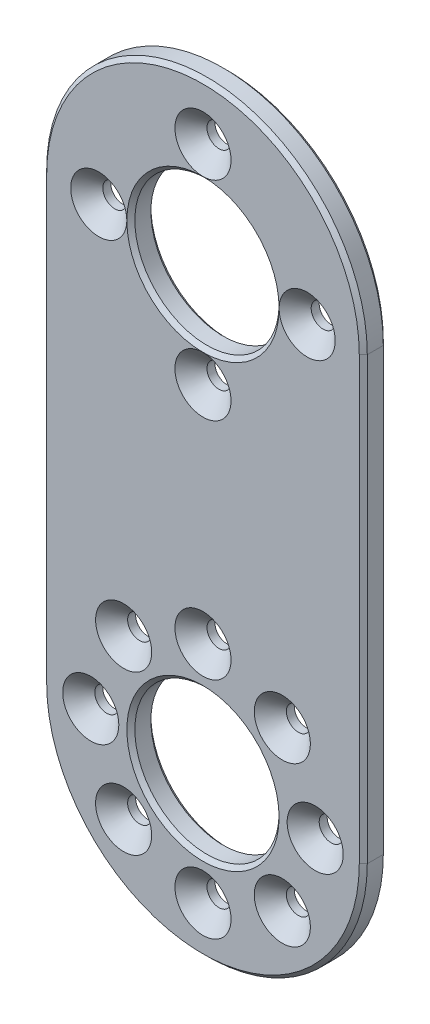
ISO-10303-21;
HEADER;
FILE_DESCRIPTION(('STEP AP214'),'2;1');
FILE_NAME('part.step','',(''),(''),'','','');
FILE_SCHEMA(('AUTOMOTIVE_DESIGN { 1 0 10303 214 1 1 1 1 }'));
ENDSEC;
DATA;
#1=APPLICATION_CONTEXT('core data for automotive mechanical design processes');
#2=APPLICATION_PROTOCOL_DEFINITION('international standard','automotive_design',2000,#1);
#3=PRODUCT_CONTEXT('',#1,'mechanical');
#4=PRODUCT('Part','Part','',(#3));
#5=PRODUCT_RELATED_PRODUCT_CATEGORY('part','',(#4));
#6=PRODUCT_DEFINITION_FORMATION('','',#4);
#7=PRODUCT_DEFINITION_CONTEXT('part definition',#1,'design');
#8=PRODUCT_DEFINITION('design','',#6,#7);
#9=PRODUCT_DEFINITION_SHAPE('','',#8);
#10=(LENGTH_UNIT() NAMED_UNIT(*) SI_UNIT(.MILLI.,.METRE.));
#11=(NAMED_UNIT(*) PLANE_ANGLE_UNIT() SI_UNIT($,.RADIAN.));
#12=(NAMED_UNIT(*) SI_UNIT($,.STERADIAN.) SOLID_ANGLE_UNIT());
#13=UNCERTAINTY_MEASURE_WITH_UNIT(LENGTH_MEASURE(1.E-05),#10,'distance_accuracy_value','');
#14=(GEOMETRIC_REPRESENTATION_CONTEXT(3) GLOBAL_UNCERTAINTY_ASSIGNED_CONTEXT((#13)) GLOBAL_UNIT_ASSIGNED_CONTEXT((#10,
#11,#12)) REPRESENTATION_CONTEXT('',''));
#15=CARTESIAN_POINT('',(0.,0.,0.));
#16=DIRECTION('',(0.,0.,1.));
#17=DIRECTION('',(1.,0.,0.));
#18=AXIS2_PLACEMENT_3D('',#15,#16,#17);
#19=CARTESIAN_POINT('',(20.,0.,3.));
#20=DIRECTION('',(0.,0.,1.));
#21=DIRECTION('',(1.,0.,0.));
#22=AXIS2_PLACEMENT_3D('',#19,#20,#21);
#23=PLANE('',#22);
#24=CARTESIAN_POINT('',(20.,0.,3.));
#25=DIRECTION('',(0.,0.,1.));
#26=DIRECTION('',(1.,0.,0.));
#27=AXIS2_PLACEMENT_3D('',#24,#25,#26);
#28=CIRCLE('',#27,9.49999999999999);
#29=CARTESIAN_POINT('',(29.5,0.,3.));
#30=VERTEX_POINT('',#29);
#31=EDGE_CURVE('E174',#30,#30,#28,.F.);
#32=ORIENTED_EDGE('',*,*,#31,.T.);
#33=EDGE_LOOP('',(#32));
#34=FACE_BOUND('',#33,.T.);
#35=DIRECTION('',(0.,1.,0.));
#36=VECTOR('',#35,1.);
#37=CARTESIAN_POINT('',(39.5,55.,3.));
#38=LINE('',#37,#36);
#39=CARTESIAN_POINT('',(39.5,0.,3.));
#40=VERTEX_POINT('',#39);
#41=CARTESIAN_POINT('',(39.5,55.,3.));
#42=VERTEX_POINT('',#41);
#43=EDGE_CURVE('E156',#40,#42,#38,.T.);
#44=ORIENTED_EDGE('',*,*,#43,.T.);
#45=CARTESIAN_POINT('',(20.,55.,3.));
#46=DIRECTION('',(0.,0.,1.));
#47=DIRECTION('',(1.,0.,0.));
#48=AXIS2_PLACEMENT_3D('',#45,#46,#47);
#49=CIRCLE('',#48,19.5);
#50=CARTESIAN_POINT('',(0.5,55.,3.));
#51=VERTEX_POINT('',#50);
#52=EDGE_CURVE('E162',#42,#51,#49,.T.);
#53=ORIENTED_EDGE('',*,*,#52,.T.);
#54=DIRECTION('',(0.,-1.,0.));
#55=VECTOR('',#54,1.);
#56=CARTESIAN_POINT('',(0.5,0.,3.));
#57=LINE('',#56,#55);
#58=CARTESIAN_POINT('',(0.499999999999987,0.,3.));
#59=VERTEX_POINT('',#58);
#60=EDGE_CURVE('E160',#51,#59,#57,.T.);
#61=ORIENTED_EDGE('',*,*,#60,.T.);
#62=CARTESIAN_POINT('',(20.,0.,3.));
#63=DIRECTION('',(0.,0.,1.));
#64=DIRECTION('',(1.,0.,0.));
#65=AXIS2_PLACEMENT_3D('',#62,#63,#64);
#66=CIRCLE('',#65,19.5);
#67=EDGE_CURVE('E158',#59,#40,#66,.T.);
#68=ORIENTED_EDGE('',*,*,#67,.T.);
#69=EDGE_LOOP('',(#44,#53,#61,#68));
#70=FACE_BOUND('',#69,.T.);
#71=CARTESIAN_POINT('',(6.,0.,3.));
#72=DIRECTION('',(0.,0.,1.));
#73=DIRECTION('',(1.,0.,0.));
#74=AXIS2_PLACEMENT_3D('',#71,#72,#73);
#75=CIRCLE('',#74,3.5);
#76=CARTESIAN_POINT('',(9.5,0.,3.));
#77=VERTEX_POINT('',#76);
#78=EDGE_CURVE('E275',#77,#77,#75,.F.);
#79=ORIENTED_EDGE('',*,*,#78,.T.);
#80=EDGE_LOOP('',(#79));
#81=FACE_BOUND('',#80,.T.);
#82=CARTESIAN_POINT('',(10.1005050633883,-9.89949493661167,3.));
#83=DIRECTION('',(0.,0.,1.));
#84=DIRECTION('',(1.,0.,0.));
#85=AXIS2_PLACEMENT_3D('',#82,#83,#84);
#86=CIRCLE('',#85,3.5);
#87=CARTESIAN_POINT('',(13.6005050633883,-9.89949493661167,3.));
#88=VERTEX_POINT('',#87);
#89=EDGE_CURVE('E272',#88,#88,#86,.F.);
#90=ORIENTED_EDGE('',*,*,#89,.T.);
#91=EDGE_LOOP('',(#90));
#92=FACE_BOUND('',#91,.T.);
#93=CARTESIAN_POINT('',(20.,-14.,3.));
#94=DIRECTION('',(0.,0.,1.));
#95=DIRECTION('',(1.,0.,0.));
#96=AXIS2_PLACEMENT_3D('',#93,#94,#95);
#97=CIRCLE('',#96,3.5);
#98=CARTESIAN_POINT('',(23.5,-14.,3.));
#99=VERTEX_POINT('',#98);
#100=EDGE_CURVE('E269',#99,#99,#97,.F.);
#101=ORIENTED_EDGE('',*,*,#100,.T.);
#102=EDGE_LOOP('',(#101));
#103=FACE_BOUND('',#102,.T.);
#104=CARTESIAN_POINT('',(29.8994949366117,-9.89949493661165,3.));
#105=DIRECTION('',(0.,0.,1.));
#106=DIRECTION('',(1.,0.,0.));
#107=AXIS2_PLACEMENT_3D('',#104,#105,#106);
#108=CIRCLE('',#107,3.5);
#109=CARTESIAN_POINT('',(33.3994949366117,-9.89949493661165,3.));
#110=VERTEX_POINT('',#109);
#111=EDGE_CURVE('E266',#110,#110,#108,.F.);
#112=ORIENTED_EDGE('',*,*,#111,.T.);
#113=EDGE_LOOP('',(#112));
#114=FACE_BOUND('',#113,.T.);
#115=CARTESIAN_POINT('',(34.,0.,3.));
#116=DIRECTION('',(0.,0.,1.));
#117=DIRECTION('',(1.,0.,0.));
#118=AXIS2_PLACEMENT_3D('',#115,#116,#117);
#119=CIRCLE('',#118,3.5);
#120=CARTESIAN_POINT('',(37.5,0.,3.));
#121=VERTEX_POINT('',#120);
#122=EDGE_CURVE('E263',#121,#121,#119,.F.);
#123=ORIENTED_EDGE('',*,*,#122,.T.);
#124=EDGE_LOOP('',(#123));
#125=FACE_BOUND('',#124,.T.);
#126=CARTESIAN_POINT('',(29.8994949366117,9.89949493661167,3.));
#127=DIRECTION('',(0.,0.,1.));
#128=DIRECTION('',(1.,0.,0.));
#129=AXIS2_PLACEMENT_3D('',#126,#127,#128);
#130=CIRCLE('',#129,3.5);
#131=CARTESIAN_POINT('',(33.3994949366117,9.89949493661167,3.));
#132=VERTEX_POINT('',#131);
#133=EDGE_CURVE('E260',#132,#132,#130,.F.);
#134=ORIENTED_EDGE('',*,*,#133,.T.);
#135=EDGE_LOOP('',(#134));
#136=FACE_BOUND('',#135,.T.);
#137=CARTESIAN_POINT('',(20.,14.,3.));
#138=DIRECTION('',(0.,0.,1.));
#139=DIRECTION('',(1.,0.,0.));
#140=AXIS2_PLACEMENT_3D('',#137,#138,#139);
#141=CIRCLE('',#140,3.5);
#142=CARTESIAN_POINT('',(23.5,14.,3.));
#143=VERTEX_POINT('',#142);
#144=EDGE_CURVE('E257',#143,#143,#141,.F.);
#145=ORIENTED_EDGE('',*,*,#144,.T.);
#146=EDGE_LOOP('',(#145));
#147=FACE_BOUND('',#146,.T.);
#148=CARTESIAN_POINT('',(10.1005050633883,9.89949493661167,3.));
#149=DIRECTION('',(0.,0.,1.));
#150=DIRECTION('',(1.,0.,0.));
#151=AXIS2_PLACEMENT_3D('',#148,#149,#150);
#152=CIRCLE('',#151,3.5);
#153=CARTESIAN_POINT('',(13.6005050633883,9.89949493661167,3.));
#154=VERTEX_POINT('',#153);
#155=EDGE_CURVE('E254',#154,#154,#152,.F.);
#156=ORIENTED_EDGE('',*,*,#155,.T.);
#157=EDGE_LOOP('',(#156));
#158=FACE_BOUND('',#157,.T.);
#159=CARTESIAN_POINT('',(33.,55.,3.));
#160=DIRECTION('',(0.,0.,1.));
#161=DIRECTION('',(1.,0.,0.));
#162=AXIS2_PLACEMENT_3D('',#159,#160,#161);
#163=CIRCLE('',#162,3.5);
#164=CARTESIAN_POINT('',(29.5,55.,3.));
#165=VERTEX_POINT('',#164);
#166=EDGE_CURVE('E248',#165,#165,#163,.F.);
#167=ORIENTED_EDGE('',*,*,#166,.T.);
#168=CARTESIAN_POINT('',(20.,55.,3.));
#169=DIRECTION('',(0.,0.,1.));
#170=DIRECTION('',(1.,0.,0.));
#171=AXIS2_PLACEMENT_3D('',#168,#169,#170);
#172=CIRCLE('',#171,9.49999999999999);
#173=CARTESIAN_POINT('',(20.,45.5,3.));
#174=VERTEX_POINT('',#173);
#175=EDGE_CURVE('E171',#165,#174,#172,.F.);
#176=ORIENTED_EDGE('',*,*,#175,.T.);
#177=CARTESIAN_POINT('',(20.,42.,3.));
#178=DIRECTION('',(0.,0.,1.));
#179=DIRECTION('',(1.,0.,0.));
#180=AXIS2_PLACEMENT_3D('',#177,#178,#179);
#181=CIRCLE('',#180,3.50000000000003);
#182=EDGE_CURVE('E251',#174,#174,#181,.F.);
#183=ORIENTED_EDGE('',*,*,#182,.T.);
#184=CARTESIAN_POINT('',(20.,55.,3.));
#185=DIRECTION('',(0.,0.,1.));
#186=DIRECTION('',(1.,0.,0.));
#187=AXIS2_PLACEMENT_3D('',#184,#185,#186);
#188=CIRCLE('',#187,9.49999999999999);
#189=CARTESIAN_POINT('',(10.5,55.,3.));
#190=VERTEX_POINT('',#189);
#191=EDGE_CURVE('E169',#174,#190,#188,.F.);
#192=ORIENTED_EDGE('',*,*,#191,.T.);
#193=CARTESIAN_POINT('',(7.,55.,3.));
#194=DIRECTION('',(0.,0.,1.));
#195=DIRECTION('',(1.,0.,0.));
#196=AXIS2_PLACEMENT_3D('',#193,#194,#195);
#197=CIRCLE('',#196,3.50000000000003);
#198=EDGE_CURVE('E242',#190,#190,#197,.F.);
#199=ORIENTED_EDGE('',*,*,#198,.T.);
#200=CARTESIAN_POINT('',(20.,55.,3.));
#201=DIRECTION('',(0.,0.,1.));
#202=DIRECTION('',(1.,0.,0.));
#203=AXIS2_PLACEMENT_3D('',#200,#201,#202);
#204=CIRCLE('',#203,9.49999999999999);
#205=CARTESIAN_POINT('',(20.,64.5,3.));
#206=VERTEX_POINT('',#205);
#207=EDGE_CURVE('E167',#190,#206,#204,.F.);
#208=ORIENTED_EDGE('',*,*,#207,.T.);
#209=CARTESIAN_POINT('',(20.,68.,3.));
#210=DIRECTION('',(0.,0.,1.));
#211=DIRECTION('',(1.,0.,0.));
#212=AXIS2_PLACEMENT_3D('',#209,#210,#211);
#213=CIRCLE('',#212,3.50000000000003);
#214=EDGE_CURVE('E245',#206,#206,#213,.F.);
#215=ORIENTED_EDGE('',*,*,#214,.T.);
#216=CARTESIAN_POINT('',(20.,55.,3.));
#217=DIRECTION('',(0.,0.,1.));
#218=DIRECTION('',(1.,0.,0.));
#219=AXIS2_PLACEMENT_3D('',#216,#217,#218);
#220=CIRCLE('',#219,9.49999999999999);
#221=EDGE_CURVE('E165',#206,#165,#220,.F.);
#222=ORIENTED_EDGE('',*,*,#221,.T.);
#223=EDGE_LOOP('',(#167,#176,#183,#192,#199,#208,#215,#222));
#224=FACE_BOUND('',#223,.T.);
#225=ADVANCED_FACE('F30',(#34,#70,#81,#92,#103,#114,#125,#136,#147,#158,#224),#23,.T.);
#226=CARTESIAN_POINT('',(20.,0.,0.));
#227=DIRECTION('',(0.,0.,1.));
#228=DIRECTION('',(1.,0.,0.));
#229=AXIS2_PLACEMENT_3D('',#226,#227,#228);
#230=PLANE('',#229);
#231=CARTESIAN_POINT('',(20.,0.,0.));
#232=DIRECTION('',(0.,0.,1.));
#233=DIRECTION('',(1.,0.,0.));
#234=AXIS2_PLACEMENT_3D('',#231,#232,#233);
#235=CIRCLE('',#234,9.49999999999999);
#236=CARTESIAN_POINT('',(29.5,0.,0.));
#237=VERTEX_POINT('',#236);
#238=EDGE_CURVE('E143',#237,#237,#235,.T.);
#239=ORIENTED_EDGE('',*,*,#238,.T.);
#240=EDGE_LOOP('',(#239));
#241=FACE_BOUND('',#240,.T.);
#242=CARTESIAN_POINT('',(20.,55.,0.));
#243=DIRECTION('',(0.,0.,1.));
#244=DIRECTION('',(1.,0.,0.));
#245=AXIS2_PLACEMENT_3D('',#242,#243,#244);
#246=CIRCLE('',#245,9.50000000000001);
#247=CARTESIAN_POINT('',(29.5,55.,0.));
#248=VERTEX_POINT('',#247);
#249=EDGE_CURVE('E140',#248,#248,#246,.T.);
#250=ORIENTED_EDGE('',*,*,#249,.T.);
#251=EDGE_LOOP('',(#250));
#252=FACE_BOUND('',#251,.T.);
#253=CARTESIAN_POINT('',(20.,0.,0.));
#254=DIRECTION('',(0.,0.,1.));
#255=DIRECTION('',(1.,0.,0.));
#256=AXIS2_PLACEMENT_3D('',#253,#254,#255);
#257=CIRCLE('',#256,19.5);
#258=CARTESIAN_POINT('',(39.5,0.,0.));
#259=VERTEX_POINT('',#258);
#260=CARTESIAN_POINT('',(0.49999999999999,0.,0.));
#261=VERTEX_POINT('',#260);
#262=EDGE_CURVE('E139',#259,#261,#257,.F.);
#263=ORIENTED_EDGE('',*,*,#262,.T.);
#264=DIRECTION('',(0.,1.,0.));
#265=VECTOR('',#264,1.);
#266=CARTESIAN_POINT('',(0.5,0.,0.));
#267=LINE('',#266,#265);
#268=CARTESIAN_POINT('',(0.5,55.,0.));
#269=VERTEX_POINT('',#268);
#270=EDGE_CURVE('E117',#261,#269,#267,.T.);
#271=ORIENTED_EDGE('',*,*,#270,.T.);
#272=CARTESIAN_POINT('',(20.,55.,0.));
#273=DIRECTION('',(0.,0.,1.));
#274=DIRECTION('',(1.,0.,0.));
#275=AXIS2_PLACEMENT_3D('',#272,#273,#274);
#276=CIRCLE('',#275,19.5);
#277=CARTESIAN_POINT('',(39.5,55.,0.));
#278=VERTEX_POINT('',#277);
#279=EDGE_CURVE('E127',#269,#278,#276,.F.);
#280=ORIENTED_EDGE('',*,*,#279,.T.);
#281=DIRECTION('',(0.,-1.,0.));
#282=VECTOR('',#281,1.);
#283=CARTESIAN_POINT('',(39.5,0.,0.));
#284=LINE('',#283,#282);
#285=EDGE_CURVE('E133',#278,#259,#284,.T.);
#286=ORIENTED_EDGE('',*,*,#285,.T.);
#287=EDGE_LOOP('',(#263,#271,#280,#286));
#288=FACE_BOUND('',#287,.T.);
#289=CARTESIAN_POINT('',(29.8994949366117,9.89949493661167,0.));
#290=DIRECTION('',(0.,0.,1.));
#291=DIRECTION('',(1.,0.,0.));
#292=AXIS2_PLACEMENT_3D('',#289,#290,#291);
#293=CIRCLE('',#292,1.5);
#294=CARTESIAN_POINT('',(31.3994949366117,9.89949493661167,0.));
#295=VERTEX_POINT('',#294);
#296=EDGE_CURVE('E396',#295,#295,#293,.T.);
#297=ORIENTED_EDGE('',*,*,#296,.T.);
#298=EDGE_LOOP('',(#297));
#299=FACE_BOUND('',#298,.T.);
#300=CARTESIAN_POINT('',(29.8994949366117,-9.89949493661165,0.));
#301=DIRECTION('',(0.,0.,1.));
#302=DIRECTION('',(1.,0.,0.));
#303=AXIS2_PLACEMENT_3D('',#300,#301,#302);
#304=CIRCLE('',#303,1.5);
#305=CARTESIAN_POINT('',(31.3994949366117,-9.89949493661165,0.));
#306=VERTEX_POINT('',#305);
#307=EDGE_CURVE('E390',#306,#306,#304,.T.);
#308=ORIENTED_EDGE('',*,*,#307,.T.);
#309=EDGE_LOOP('',(#308));
#310=FACE_BOUND('',#309,.T.);
#311=CARTESIAN_POINT('',(10.1005050633883,-9.89949493661167,0.));
#312=DIRECTION('',(0.,0.,1.));
#313=DIRECTION('',(1.,0.,0.));
#314=AXIS2_PLACEMENT_3D('',#311,#312,#313);
#315=CIRCLE('',#314,1.5);
#316=CARTESIAN_POINT('',(11.6005050633883,-9.89949493661167,0.));
#317=VERTEX_POINT('',#316);
#318=EDGE_CURVE('E384',#317,#317,#315,.T.);
#319=ORIENTED_EDGE('',*,*,#318,.T.);
#320=EDGE_LOOP('',(#319));
#321=FACE_BOUND('',#320,.T.);
#322=CARTESIAN_POINT('',(10.1005050633883,9.89949493661167,0.));
#323=DIRECTION('',(0.,0.,1.));
#324=DIRECTION('',(1.,0.,0.));
#325=AXIS2_PLACEMENT_3D('',#322,#323,#324);
#326=CIRCLE('',#325,1.5);
#327=CARTESIAN_POINT('',(11.6005050633883,9.89949493661167,0.));
#328=VERTEX_POINT('',#327);
#329=EDGE_CURVE('E378',#328,#328,#326,.T.);
#330=ORIENTED_EDGE('',*,*,#329,.T.);
#331=EDGE_LOOP('',(#330));
#332=FACE_BOUND('',#331,.T.);
#333=CARTESIAN_POINT('',(7.,55.,0.));
#334=DIRECTION('',(0.,0.,1.));
#335=DIRECTION('',(1.,0.,0.));
#336=AXIS2_PLACEMENT_3D('',#333,#334,#335);
#337=CIRCLE('',#336,1.5);
#338=CARTESIAN_POINT('',(8.5,55.,0.));
#339=VERTEX_POINT('',#338);
#340=EDGE_CURVE('E371',#339,#339,#337,.T.);
#341=ORIENTED_EDGE('',*,*,#340,.T.);
#342=EDGE_LOOP('',(#341));
#343=FACE_BOUND('',#342,.T.);
#344=CARTESIAN_POINT('',(20.,68.,0.));
#345=DIRECTION('',(0.,0.,1.));
#346=DIRECTION('',(1.,0.,0.));
#347=AXIS2_PLACEMENT_3D('',#344,#345,#346);
#348=CIRCLE('',#347,1.5);
#349=CARTESIAN_POINT('',(21.5,68.,0.));
#350=VERTEX_POINT('',#349);
#351=EDGE_CURVE('E228',#350,#350,#348,.T.);
#352=ORIENTED_EDGE('',*,*,#351,.T.);
#353=EDGE_LOOP('',(#352));
#354=FACE_BOUND('',#353,.T.);
#355=CARTESIAN_POINT('',(20.,42.,0.));
#356=DIRECTION('',(0.,0.,1.));
#357=DIRECTION('',(-1.,0.,0.));
#358=AXIS2_PLACEMENT_3D('',#355,#356,#357);
#359=CIRCLE('',#358,1.5);
#360=CARTESIAN_POINT('',(18.5,42.,0.));
#361=VERTEX_POINT('',#360);
#362=EDGE_CURVE('E233',#361,#361,#359,.T.);
#363=ORIENTED_EDGE('',*,*,#362,.T.);
#364=EDGE_LOOP('',(#363));
#365=FACE_BOUND('',#364,.T.);
#366=CARTESIAN_POINT('',(33.,55.,0.));
#367=DIRECTION('',(0.,0.,1.));
#368=DIRECTION('',(-1.,0.,0.));
#369=AXIS2_PLACEMENT_3D('',#366,#367,#368);
#370=CIRCLE('',#369,1.5);
#371=CARTESIAN_POINT('',(31.5,55.,0.));
#372=VERTEX_POINT('',#371);
#373=EDGE_CURVE('E373',#372,#372,#370,.T.);
#374=ORIENTED_EDGE('',*,*,#373,.T.);
#375=EDGE_LOOP('',(#374));
#376=FACE_BOUND('',#375,.T.);
#377=CARTESIAN_POINT('',(6.,0.,0.));
#378=DIRECTION('',(0.,0.,1.));
#379=DIRECTION('',(1.,0.,0.));
#380=AXIS2_PLACEMENT_3D('',#377,#378,#379);
#381=CIRCLE('',#380,1.5);
#382=CARTESIAN_POINT('',(7.5,0.,0.));
#383=VERTEX_POINT('',#382);
#384=EDGE_CURVE('E381',#383,#383,#381,.T.);
#385=ORIENTED_EDGE('',*,*,#384,.T.);
#386=EDGE_LOOP('',(#385));
#387=FACE_BOUND('',#386,.T.);
#388=CARTESIAN_POINT('',(20.,-14.,0.));
#389=DIRECTION('',(0.,0.,1.));
#390=DIRECTION('',(1.,0.,0.));
#391=AXIS2_PLACEMENT_3D('',#388,#389,#390);
#392=CIRCLE('',#391,1.5);
#393=CARTESIAN_POINT('',(21.5,-14.,0.));
#394=VERTEX_POINT('',#393);
#395=EDGE_CURVE('E387',#394,#394,#392,.T.);
#396=ORIENTED_EDGE('',*,*,#395,.T.);
#397=EDGE_LOOP('',(#396));
#398=FACE_BOUND('',#397,.T.);
#399=CARTESIAN_POINT('',(34.,0.,0.));
#400=DIRECTION('',(0.,0.,1.));
#401=DIRECTION('',(1.,0.,0.));
#402=AXIS2_PLACEMENT_3D('',#399,#400,#401);
#403=CIRCLE('',#402,1.5);
#404=CARTESIAN_POINT('',(35.5,0.,0.));
#405=VERTEX_POINT('',#404);
#406=EDGE_CURVE('E393',#405,#405,#403,.T.);
#407=ORIENTED_EDGE('',*,*,#406,.T.);
#408=EDGE_LOOP('',(#407));
#409=FACE_BOUND('',#408,.T.);
#410=CARTESIAN_POINT('',(20.,14.,0.));
#411=DIRECTION('',(0.,0.,1.));
#412=DIRECTION('',(1.,0.,0.));
#413=AXIS2_PLACEMENT_3D('',#410,#411,#412);
#414=CIRCLE('',#413,1.5);
#415=CARTESIAN_POINT('',(21.5,14.,0.));
#416=VERTEX_POINT('',#415);
#417=EDGE_CURVE('E199',#416,#416,#414,.T.);
#418=ORIENTED_EDGE('',*,*,#417,.T.);
#419=EDGE_LOOP('',(#418));
#420=FACE_BOUND('',#419,.T.);
#421=ADVANCED_FACE('F136',(#241,#252,#288,#299,#310,#321,#332,#343,#354,#365,#376,#387,#398,
#409,#420),#230,.F.);
#422=CARTESIAN_POINT('',(20.,0.,3.));
#423=DIRECTION('',(0.,0.,-1.));
#424=DIRECTION('',(-1.,0.,0.));
#425=AXIS2_PLACEMENT_3D('',#422,#423,#424);
#426=CYLINDRICAL_SURFACE('',#425,20.);
#427=DIRECTION('',(0.,0.,-1.));
#428=VECTOR('',#427,1.);
#429=CARTESIAN_POINT('',(0.,0.,3.));
#430=LINE('',#429,#428);
#431=CARTESIAN_POINT('',(0.,0.,2.5));
#432=VERTEX_POINT('',#431);
#433=CARTESIAN_POINT('',(0.,0.,0.499999999999994));
#434=VERTEX_POINT('',#433);
#435=EDGE_CURVE('E221',#432,#434,#430,.T.);
#436=ORIENTED_EDGE('',*,*,#435,.T.);
#437=CARTESIAN_POINT('',(20.,0.,0.499999999999994));
#438=DIRECTION('',(0.,0.,1.));
#439=DIRECTION('',(1.,0.,0.));
#440=AXIS2_PLACEMENT_3D('',#437,#438,#439);
#441=CIRCLE('',#440,20.);
#442=CARTESIAN_POINT('',(40.,0.,0.499999999999994));
#443=VERTEX_POINT('',#442);
#444=EDGE_CURVE('E188',#434,#443,#441,.T.);
#445=ORIENTED_EDGE('',*,*,#444,.T.);
#446=DIRECTION('',(0.,0.,-1.));
#447=VECTOR('',#446,1.);
#448=CARTESIAN_POINT('',(40.,0.,3.));
#449=LINE('',#448,#447);
#450=CARTESIAN_POINT('',(40.,0.,2.5));
#451=VERTEX_POINT('',#450);
#452=EDGE_CURVE('E222',#451,#443,#449,.T.);
#453=ORIENTED_EDGE('',*,*,#452,.F.);
#454=CARTESIAN_POINT('',(20.,0.,2.5));
#455=DIRECTION('',(0.,0.,1.));
#456=DIRECTION('',(1.,0.,0.));
#457=AXIS2_PLACEMENT_3D('',#454,#455,#456);
#458=CIRCLE('',#457,20.);
#459=EDGE_CURVE('E186',#451,#432,#458,.F.);
#460=ORIENTED_EDGE('',*,*,#459,.T.);
#461=EDGE_LOOP('',(#436,#445,#453,#460));
#462=FACE_BOUND('',#461,.T.);
#463=ADVANCED_FACE('F220',(#462),#426,.T.);
#464=CARTESIAN_POINT('',(40.,55.,3.));
#465=DIRECTION('',(-1.,0.,0.));
#466=DIRECTION('',(0.,-1.,0.));
#467=AXIS2_PLACEMENT_3D('',#464,#465,#466);
#468=PLANE('',#467);
#469=ORIENTED_EDGE('',*,*,#452,.T.);
#470=DIRECTION('',(0.,1.,0.));
#471=VECTOR('',#470,1.);
#472=CARTESIAN_POINT('',(40.,55.,0.499999999999994));
#473=LINE('',#472,#471);
#474=CARTESIAN_POINT('',(40.,55.,0.499999999999994));
#475=VERTEX_POINT('',#474);
#476=EDGE_CURVE('E47',#443,#475,#473,.T.);
#477=ORIENTED_EDGE('',*,*,#476,.T.);
#478=DIRECTION('',(0.,0.,-1.));
#479=VECTOR('',#478,1.);
#480=CARTESIAN_POINT('',(40.,55.,3.));
#481=LINE('',#480,#479);
#482=CARTESIAN_POINT('',(40.,55.,2.5));
#483=VERTEX_POINT('',#482);
#484=EDGE_CURVE('E230',#483,#475,#481,.T.);
#485=ORIENTED_EDGE('',*,*,#484,.F.);
#486=DIRECTION('',(0.,-1.,0.));
#487=VECTOR('',#486,1.);
#488=CARTESIAN_POINT('',(40.,0.,2.5));
#489=LINE('',#488,#487);
#490=EDGE_CURVE('E190',#483,#451,#489,.T.);
#491=ORIENTED_EDGE('',*,*,#490,.T.);
#492=EDGE_LOOP('',(#469,#477,#485,#491));
#493=FACE_BOUND('',#492,.T.);
#494=ADVANCED_FACE('F315',(#493),#468,.F.);
#495=CARTESIAN_POINT('',(20.,55.,3.));
#496=DIRECTION('',(0.,0.,-1.));
#497=DIRECTION('',(-1.,0.,0.));
#498=AXIS2_PLACEMENT_3D('',#495,#496,#497);
#499=CYLINDRICAL_SURFACE('',#498,20.);
#500=ORIENTED_EDGE('',*,*,#484,.T.);
#501=CARTESIAN_POINT('',(20.,55.,0.499999999999994));
#502=DIRECTION('',(0.,0.,1.));
#503=DIRECTION('',(1.,0.,0.));
#504=AXIS2_PLACEMENT_3D('',#501,#502,#503);
#505=CIRCLE('',#504,20.);
#506=CARTESIAN_POINT('',(0.,55.,0.499999999999994));
#507=VERTEX_POINT('',#506);
#508=EDGE_CURVE('E11',#475,#507,#505,.T.);
#509=ORIENTED_EDGE('',*,*,#508,.T.);
#510=DIRECTION('',(0.,0.,-1.));
#511=VECTOR('',#510,1.);
#512=CARTESIAN_POINT('',(0.,55.,3.));
#513=LINE('',#512,#511);
#514=CARTESIAN_POINT('',(0.,55.,2.5));
#515=VERTEX_POINT('',#514);
#516=EDGE_CURVE('E227',#515,#507,#513,.T.);
#517=ORIENTED_EDGE('',*,*,#516,.F.);
#518=CARTESIAN_POINT('',(20.,55.,2.5));
#519=DIRECTION('',(0.,0.,1.));
#520=DIRECTION('',(1.,0.,0.));
#521=AXIS2_PLACEMENT_3D('',#518,#519,#520);
#522=CIRCLE('',#521,20.);
#523=EDGE_CURVE('E39',#515,#483,#522,.F.);
#524=ORIENTED_EDGE('',*,*,#523,.T.);
#525=EDGE_LOOP('',(#500,#509,#517,#524));
#526=FACE_BOUND('',#525,.T.);
#527=ADVANCED_FACE('F317',(#526),#499,.T.);
#528=CARTESIAN_POINT('',(0.,0.,3.));
#529=DIRECTION('',(1.,0.,0.));
#530=DIRECTION('',(0.,0.,-1.));
#531=AXIS2_PLACEMENT_3D('',#528,#529,#530);
#532=PLANE('',#531);
#533=ORIENTED_EDGE('',*,*,#516,.T.);
#534=DIRECTION('',(0.,-1.,0.));
#535=VECTOR('',#534,1.);
#536=CARTESIAN_POINT('',(0.,0.,0.499999999999994));
#537=LINE('',#536,#535);
#538=EDGE_CURVE('E120',#507,#434,#537,.T.);
#539=ORIENTED_EDGE('',*,*,#538,.T.);
#540=ORIENTED_EDGE('',*,*,#435,.F.);
#541=DIRECTION('',(0.,1.,0.));
#542=VECTOR('',#541,1.);
#543=CARTESIAN_POINT('',(0.,55.,2.5));
#544=LINE('',#543,#542);
#545=EDGE_CURVE('E183',#432,#515,#544,.T.);
#546=ORIENTED_EDGE('',*,*,#545,.T.);
#547=EDGE_LOOP('',(#533,#539,#540,#546));
#548=FACE_BOUND('',#547,.T.);
#549=ADVANCED_FACE('F225',(#548),#532,.F.);
#550=CARTESIAN_POINT('',(20.,55.,3.));
#551=DIRECTION('',(0.,0.,-1.));
#552=DIRECTION('',(-1.,0.,0.));
#553=AXIS2_PLACEMENT_3D('',#550,#551,#552);
#554=CYLINDRICAL_SURFACE('',#553,9.00000000000001);
#555=CARTESIAN_POINT('',(20.,55.,2.50000000000003));
#556=DIRECTION('',(0.,0.,1.));
#557=DIRECTION('',(1.,0.,0.));
#558=AXIS2_PLACEMENT_3D('',#555,#556,#557);
#559=CIRCLE('',#558,9.00000000000001);
#560=CARTESIAN_POINT('',(29.,55.,2.50000000000003));
#561=VERTEX_POINT('',#560);
#562=EDGE_CURVE('E180',#561,#561,#559,.T.);
#563=ORIENTED_EDGE('',*,*,#562,.T.);
#564=EDGE_LOOP('',(#563));
#565=FACE_BOUND('',#564,.T.);
#566=CARTESIAN_POINT('',(20.,55.,0.499999999999994));
#567=DIRECTION('',(0.,0.,1.));
#568=DIRECTION('',(1.,0.,0.));
#569=AXIS2_PLACEMENT_3D('',#566,#567,#568);
#570=CIRCLE('',#569,9.00000000000001);
#571=CARTESIAN_POINT('',(29.,55.,0.499999999999994));
#572=VERTEX_POINT('',#571);
#573=EDGE_CURVE('E177',#572,#572,#570,.F.);
#574=ORIENTED_EDGE('',*,*,#573,.T.);
#575=EDGE_LOOP('',(#574));
#576=FACE_BOUND('',#575,.T.);
#577=ADVANCED_FACE('F456',(#565,#576),#554,.F.);
#578=CARTESIAN_POINT('',(20.,0.,3.));
#579=DIRECTION('',(0.,0.,-1.));
#580=DIRECTION('',(-1.,0.,0.));
#581=AXIS2_PLACEMENT_3D('',#578,#579,#580);
#582=CYLINDRICAL_SURFACE('',#581,9.);
#583=CARTESIAN_POINT('',(20.,0.,0.49999999999999));
#584=DIRECTION('',(0.,0.,1.));
#585=DIRECTION('',(1.,0.,0.));
#586=AXIS2_PLACEMENT_3D('',#583,#584,#585);
#587=CIRCLE('',#586,9.);
#588=CARTESIAN_POINT('',(29.,0.,0.49999999999999));
#589=VERTEX_POINT('',#588);
#590=EDGE_CURVE('E153',#589,#589,#587,.F.);
#591=ORIENTED_EDGE('',*,*,#590,.T.);
#592=EDGE_LOOP('',(#591));
#593=FACE_BOUND('',#592,.T.);
#594=CARTESIAN_POINT('',(20.,0.,2.50000000000002));
#595=DIRECTION('',(0.,0.,1.));
#596=DIRECTION('',(1.,0.,0.));
#597=AXIS2_PLACEMENT_3D('',#594,#595,#596);
#598=CIRCLE('',#597,9.);
#599=CARTESIAN_POINT('',(29.,0.,2.50000000000002));
#600=VERTEX_POINT('',#599);
#601=EDGE_CURVE('E150',#600,#600,#598,.T.);
#602=ORIENTED_EDGE('',*,*,#601,.T.);
#603=EDGE_LOOP('',(#602));
#604=FACE_BOUND('',#603,.T.);
#605=ADVANCED_FACE('F452',(#593,#604),#582,.F.);
#606=CARTESIAN_POINT('',(20.,68.,3.));
#607=DIRECTION('',(0.,0.,-1.));
#608=DIRECTION('',(-1.,0.,0.));
#609=AXIS2_PLACEMENT_3D('',#606,#607,#608);
#610=CYLINDRICAL_SURFACE('',#609,1.5);
#611=CARTESIAN_POINT('',(20.,68.,0.999999999999975));
#612=DIRECTION('',(0.,0.,1.));
#613=DIRECTION('',(1.,0.,0.));
#614=AXIS2_PLACEMENT_3D('',#611,#612,#613);
#615=CIRCLE('',#614,1.5);
#616=CARTESIAN_POINT('',(21.5,68.,0.999999999999975));
#617=VERTEX_POINT('',#616);
#618=EDGE_CURVE('E305',#617,#617,#615,.T.);
#619=ORIENTED_EDGE('',*,*,#618,.T.);
#620=EDGE_LOOP('',(#619));
#621=FACE_BOUND('',#620,.T.);
#622=ORIENTED_EDGE('',*,*,#351,.F.);
#623=EDGE_LOOP('',(#622));
#624=FACE_BOUND('',#623,.T.);
#625=ADVANCED_FACE('F366',(#621,#624),#610,.F.);
#626=CARTESIAN_POINT('',(20.,42.,3.));
#627=DIRECTION('',(0.,0.,-1.));
#628=DIRECTION('',(-1.,0.,0.));
#629=AXIS2_PLACEMENT_3D('',#626,#627,#628);
#630=CYLINDRICAL_SURFACE('',#629,1.5);
#631=CARTESIAN_POINT('',(20.,42.,0.999999999999975));
#632=DIRECTION('',(0.,0.,1.));
#633=DIRECTION('',(1.,0.,0.));
#634=AXIS2_PLACEMENT_3D('',#631,#632,#633);
#635=CIRCLE('',#634,1.5);
#636=CARTESIAN_POINT('',(21.5,42.,0.999999999999975));
#637=VERTEX_POINT('',#636);
#638=EDGE_CURVE('E299',#637,#637,#635,.T.);
#639=ORIENTED_EDGE('',*,*,#638,.T.);
#640=EDGE_LOOP('',(#639));
#641=FACE_BOUND('',#640,.T.);
#642=ORIENTED_EDGE('',*,*,#362,.F.);
#643=EDGE_LOOP('',(#642));
#644=FACE_BOUND('',#643,.T.);
#645=ADVANCED_FACE('F362',(#641,#644),#630,.F.);
#646=CARTESIAN_POINT('',(7.,55.,3.));
#647=DIRECTION('',(0.,0.,-1.));
#648=DIRECTION('',(-1.,0.,0.));
#649=AXIS2_PLACEMENT_3D('',#646,#647,#648);
#650=CYLINDRICAL_SURFACE('',#649,1.5);
#651=CARTESIAN_POINT('',(7.,55.,0.999999999999981));
#652=DIRECTION('',(0.,0.,1.));
#653=DIRECTION('',(1.,0.,0.));
#654=AXIS2_PLACEMENT_3D('',#651,#652,#653);
#655=CIRCLE('',#654,1.5);
#656=CARTESIAN_POINT('',(8.5,55.,0.999999999999981));
#657=VERTEX_POINT('',#656);
#658=EDGE_CURVE('E134',#657,#657,#655,.T.);
#659=ORIENTED_EDGE('',*,*,#658,.T.);
#660=EDGE_LOOP('',(#659));
#661=FACE_BOUND('',#660,.T.);
#662=ORIENTED_EDGE('',*,*,#340,.F.);
#663=EDGE_LOOP('',(#662));
#664=FACE_BOUND('',#663,.T.);
#665=ADVANCED_FACE('F365',(#661,#664),#650,.F.);
#666=CARTESIAN_POINT('',(33.,55.,3.));
#667=DIRECTION('',(0.,0.,-1.));
#668=DIRECTION('',(-1.,0.,0.));
#669=AXIS2_PLACEMENT_3D('',#666,#667,#668);
#670=CYLINDRICAL_SURFACE('',#669,1.5);
#671=CARTESIAN_POINT('',(33.,55.,1.00000000000001));
#672=DIRECTION('',(0.,0.,1.));
#673=DIRECTION('',(1.,0.,0.));
#674=AXIS2_PLACEMENT_3D('',#671,#672,#673);
#675=CIRCLE('',#674,1.5);
#676=CARTESIAN_POINT('',(34.5,55.,1.00000000000001));
#677=VERTEX_POINT('',#676);
#678=EDGE_CURVE('E302',#677,#677,#675,.T.);
#679=ORIENTED_EDGE('',*,*,#678,.T.);
#680=EDGE_LOOP('',(#679));
#681=FACE_BOUND('',#680,.T.);
#682=ORIENTED_EDGE('',*,*,#373,.F.);
#683=EDGE_LOOP('',(#682));
#684=FACE_BOUND('',#683,.T.);
#685=ADVANCED_FACE('F442',(#681,#684),#670,.F.);
#686=CARTESIAN_POINT('',(10.1005050633883,9.89949493661167,3.));
#687=DIRECTION('',(0.,0.,-1.));
#688=DIRECTION('',(-1.,0.,0.));
#689=AXIS2_PLACEMENT_3D('',#686,#687,#688);
#690=CYLINDRICAL_SURFACE('',#689,1.5);
#691=CARTESIAN_POINT('',(10.1005050633883,9.89949493661167,1.00000000000001));
#692=DIRECTION('',(0.,0.,1.));
#693=DIRECTION('',(1.,0.,0.));
#694=AXIS2_PLACEMENT_3D('',#691,#692,#693);
#695=CIRCLE('',#694,1.5);
#696=CARTESIAN_POINT('',(11.6005050633883,9.89949493661167,1.00000000000001));
#697=VERTEX_POINT('',#696);
#698=EDGE_CURVE('E296',#697,#697,#695,.T.);
#699=ORIENTED_EDGE('',*,*,#698,.T.);
#700=EDGE_LOOP('',(#699));
#701=FACE_BOUND('',#700,.T.);
#702=ORIENTED_EDGE('',*,*,#329,.F.);
#703=EDGE_LOOP('',(#702));
#704=FACE_BOUND('',#703,.T.);
#705=ADVANCED_FACE('F438',(#701,#704),#690,.F.);
#706=CARTESIAN_POINT('',(6.,0.,3.));
#707=DIRECTION('',(0.,0.,-1.));
#708=DIRECTION('',(-1.,0.,0.));
#709=AXIS2_PLACEMENT_3D('',#706,#707,#708);
#710=CYLINDRICAL_SURFACE('',#709,1.5);
#711=CARTESIAN_POINT('',(6.,0.,1.));
#712=DIRECTION('',(0.,0.,1.));
#713=DIRECTION('',(1.,0.,0.));
#714=AXIS2_PLACEMENT_3D('',#711,#712,#713);
#715=CIRCLE('',#714,1.5);
#716=CARTESIAN_POINT('',(7.5,0.,1.));
#717=VERTEX_POINT('',#716);
#718=EDGE_CURVE('E239',#717,#717,#715,.T.);
#719=ORIENTED_EDGE('',*,*,#718,.T.);
#720=EDGE_LOOP('',(#719));
#721=FACE_BOUND('',#720,.T.);
#722=ORIENTED_EDGE('',*,*,#384,.F.);
#723=EDGE_LOOP('',(#722));
#724=FACE_BOUND('',#723,.T.);
#725=ADVANCED_FACE('F434',(#721,#724),#710,.F.);
#726=CARTESIAN_POINT('',(10.1005050633883,-9.89949493661167,3.));
#727=DIRECTION('',(0.,0.,-1.));
#728=DIRECTION('',(-1.,0.,0.));
#729=AXIS2_PLACEMENT_3D('',#726,#727,#728);
#730=CYLINDRICAL_SURFACE('',#729,1.5);
#731=CARTESIAN_POINT('',(10.1005050633883,-9.89949493661167,1.00000000000001));
#732=DIRECTION('',(0.,0.,1.));
#733=DIRECTION('',(1.,0.,0.));
#734=AXIS2_PLACEMENT_3D('',#731,#732,#733);
#735=CIRCLE('',#734,1.5);
#736=CARTESIAN_POINT('',(11.6005050633883,-9.89949493661167,1.00000000000001));
#737=VERTEX_POINT('',#736);
#738=EDGE_CURVE('E278',#737,#737,#735,.T.);
#739=ORIENTED_EDGE('',*,*,#738,.T.);
#740=EDGE_LOOP('',(#739));
#741=FACE_BOUND('',#740,.T.);
#742=ORIENTED_EDGE('',*,*,#318,.F.);
#743=EDGE_LOOP('',(#742));
#744=FACE_BOUND('',#743,.T.);
#745=ADVANCED_FACE('F430',(#741,#744),#730,.F.);
#746=CARTESIAN_POINT('',(20.,-14.,3.));
#747=DIRECTION('',(0.,0.,-1.));
#748=DIRECTION('',(-1.,0.,0.));
#749=AXIS2_PLACEMENT_3D('',#746,#747,#748);
#750=CYLINDRICAL_SURFACE('',#749,1.5);
#751=CARTESIAN_POINT('',(20.,-14.,1.00000000000001));
#752=DIRECTION('',(0.,0.,1.));
#753=DIRECTION('',(1.,0.,0.));
#754=AXIS2_PLACEMENT_3D('',#751,#752,#753);
#755=CIRCLE('',#754,1.5);
#756=CARTESIAN_POINT('',(21.5,-14.,1.00000000000001));
#757=VERTEX_POINT('',#756);
#758=EDGE_CURVE('E281',#757,#757,#755,.T.);
#759=ORIENTED_EDGE('',*,*,#758,.T.);
#760=EDGE_LOOP('',(#759));
#761=FACE_BOUND('',#760,.T.);
#762=ORIENTED_EDGE('',*,*,#395,.F.);
#763=EDGE_LOOP('',(#762));
#764=FACE_BOUND('',#763,.T.);
#765=ADVANCED_FACE('F426',(#761,#764),#750,.F.);
#766=CARTESIAN_POINT('',(29.8994949366117,-9.89949493661165,3.));
#767=DIRECTION('',(0.,0.,-1.));
#768=DIRECTION('',(-1.,0.,0.));
#769=AXIS2_PLACEMENT_3D('',#766,#767,#768);
#770=CYLINDRICAL_SURFACE('',#769,1.5);
#771=CARTESIAN_POINT('',(29.8994949366117,-9.89949493661165,1.00000000000001));
#772=DIRECTION('',(0.,0.,1.));
#773=DIRECTION('',(1.,0.,0.));
#774=AXIS2_PLACEMENT_3D('',#771,#772,#773);
#775=CIRCLE('',#774,1.5);
#776=CARTESIAN_POINT('',(31.3994949366117,-9.89949493661165,1.00000000000001));
#777=VERTEX_POINT('',#776);
#778=EDGE_CURVE('E284',#777,#777,#775,.T.);
#779=ORIENTED_EDGE('',*,*,#778,.T.);
#780=EDGE_LOOP('',(#779));
#781=FACE_BOUND('',#780,.T.);
#782=ORIENTED_EDGE('',*,*,#307,.F.);
#783=EDGE_LOOP('',(#782));
#784=FACE_BOUND('',#783,.T.);
#785=ADVANCED_FACE('F422',(#781,#784),#770,.F.);
#786=CARTESIAN_POINT('',(34.,0.,3.));
#787=DIRECTION('',(0.,0.,-1.));
#788=DIRECTION('',(-1.,0.,0.));
#789=AXIS2_PLACEMENT_3D('',#786,#787,#788);
#790=CYLINDRICAL_SURFACE('',#789,1.5);
#791=CARTESIAN_POINT('',(34.,0.,1.00000000000001));
#792=DIRECTION('',(0.,0.,1.));
#793=DIRECTION('',(1.,0.,0.));
#794=AXIS2_PLACEMENT_3D('',#791,#792,#793);
#795=CIRCLE('',#794,1.5);
#796=CARTESIAN_POINT('',(35.5,0.,1.00000000000001));
#797=VERTEX_POINT('',#796);
#798=EDGE_CURVE('E287',#797,#797,#795,.T.);
#799=ORIENTED_EDGE('',*,*,#798,.T.);
#800=EDGE_LOOP('',(#799));
#801=FACE_BOUND('',#800,.T.);
#802=ORIENTED_EDGE('',*,*,#406,.F.);
#803=EDGE_LOOP('',(#802));
#804=FACE_BOUND('',#803,.T.);
#805=ADVANCED_FACE('F416',(#801,#804),#790,.F.);
#806=CARTESIAN_POINT('',(29.8994949366117,9.89949493661167,3.));
#807=DIRECTION('',(0.,0.,-1.));
#808=DIRECTION('',(-1.,0.,0.));
#809=AXIS2_PLACEMENT_3D('',#806,#807,#808);
#810=CYLINDRICAL_SURFACE('',#809,1.5);
#811=CARTESIAN_POINT('',(29.8994949366117,9.89949493661167,1.00000000000001));
#812=DIRECTION('',(0.,0.,1.));
#813=DIRECTION('',(1.,0.,0.));
#814=AXIS2_PLACEMENT_3D('',#811,#812,#813);
#815=CIRCLE('',#814,1.5);
#816=CARTESIAN_POINT('',(31.3994949366117,9.89949493661167,1.00000000000001));
#817=VERTEX_POINT('',#816);
#818=EDGE_CURVE('E290',#817,#817,#815,.T.);
#819=ORIENTED_EDGE('',*,*,#818,.T.);
#820=EDGE_LOOP('',(#819));
#821=FACE_BOUND('',#820,.T.);
#822=ORIENTED_EDGE('',*,*,#296,.F.);
#823=EDGE_LOOP('',(#822));
#824=FACE_BOUND('',#823,.T.);
#825=ADVANCED_FACE('F406',(#821,#824),#810,.F.);
#826=CARTESIAN_POINT('',(20.,14.,3.));
#827=DIRECTION('',(0.,0.,-1.));
#828=DIRECTION('',(-1.,0.,0.));
#829=AXIS2_PLACEMENT_3D('',#826,#827,#828);
#830=CYLINDRICAL_SURFACE('',#829,1.5);
#831=CARTESIAN_POINT('',(20.,14.,1.00000000000001));
#832=DIRECTION('',(0.,0.,1.));
#833=DIRECTION('',(1.,0.,0.));
#834=AXIS2_PLACEMENT_3D('',#831,#832,#833);
#835=CIRCLE('',#834,1.5);
#836=CARTESIAN_POINT('',(21.5,14.,1.00000000000001));
#837=VERTEX_POINT('',#836);
#838=EDGE_CURVE('E293',#837,#837,#835,.T.);
#839=ORIENTED_EDGE('',*,*,#838,.T.);
#840=EDGE_LOOP('',(#839));
#841=FACE_BOUND('',#840,.T.);
#842=ORIENTED_EDGE('',*,*,#417,.F.);
#843=EDGE_LOOP('',(#842));
#844=FACE_BOUND('',#843,.T.);
#845=ADVANCED_FACE('F403',(#841,#844),#830,.F.);
#846=CARTESIAN_POINT('',(6.,0.,1.));
#847=DIRECTION('',(0.,0.,1.));
#848=DIRECTION('',(1.,0.,0.));
#849=AXIS2_PLACEMENT_3D('',#846,#847,#848);
#850=CONICAL_SURFACE('',#849,1.5,0.78539816339745);
#851=ORIENTED_EDGE('',*,*,#78,.F.);
#852=EDGE_LOOP('',(#851));
#853=FACE_BOUND('',#852,.T.);
#854=ORIENTED_EDGE('',*,*,#718,.F.);
#855=EDGE_LOOP('',(#854));
#856=FACE_BOUND('',#855,.T.);
#857=ADVANCED_FACE('F405',(#853,#856),#850,.F.);
#858=CARTESIAN_POINT('',(10.1005050633883,-9.89949493661167,1.00000000000001));
#859=DIRECTION('',(0.,0.,1.));
#860=DIRECTION('',(1.,0.,0.));
#861=AXIS2_PLACEMENT_3D('',#858,#859,#860);
#862=CONICAL_SURFACE('',#861,1.5,0.785398163397451);
#863=ORIENTED_EDGE('',*,*,#89,.F.);
#864=EDGE_LOOP('',(#863));
#865=FACE_BOUND('',#864,.T.);
#866=ORIENTED_EDGE('',*,*,#738,.F.);
#867=EDGE_LOOP('',(#866));
#868=FACE_BOUND('',#867,.T.);
#869=ADVANCED_FACE('F413',(#865,#868),#862,.F.);
#870=CARTESIAN_POINT('',(20.,-14.,1.00000000000001));
#871=DIRECTION('',(0.,0.,1.));
#872=DIRECTION('',(1.,0.,0.));
#873=AXIS2_PLACEMENT_3D('',#870,#871,#872);
#874=CONICAL_SURFACE('',#873,1.5,0.785398163397451);
#875=ORIENTED_EDGE('',*,*,#100,.F.);
#876=EDGE_LOOP('',(#875));
#877=FACE_BOUND('',#876,.T.);
#878=ORIENTED_EDGE('',*,*,#758,.F.);
#879=EDGE_LOOP('',(#878));
#880=FACE_BOUND('',#879,.T.);
#881=ADVANCED_FACE('F474',(#877,#880),#874,.F.);
#882=CARTESIAN_POINT('',(29.8994949366117,-9.89949493661165,1.00000000000001));
#883=DIRECTION('',(0.,0.,1.));
#884=DIRECTION('',(1.,0.,0.));
#885=AXIS2_PLACEMENT_3D('',#882,#883,#884);
#886=CONICAL_SURFACE('',#885,1.5,0.78539816339745);
#887=ORIENTED_EDGE('',*,*,#111,.F.);
#888=EDGE_LOOP('',(#887));
#889=FACE_BOUND('',#888,.T.);
#890=ORIENTED_EDGE('',*,*,#778,.F.);
#891=EDGE_LOOP('',(#890));
#892=FACE_BOUND('',#891,.T.);
#893=ADVANCED_FACE('F478',(#889,#892),#886,.F.);
#894=CARTESIAN_POINT('',(34.,0.,1.00000000000001));
#895=DIRECTION('',(0.,0.,1.));
#896=DIRECTION('',(1.,0.,0.));
#897=AXIS2_PLACEMENT_3D('',#894,#895,#896);
#898=CONICAL_SURFACE('',#897,1.5,0.785398163397451);
#899=ORIENTED_EDGE('',*,*,#122,.F.);
#900=EDGE_LOOP('',(#899));
#901=FACE_BOUND('',#900,.T.);
#902=ORIENTED_EDGE('',*,*,#798,.F.);
#903=EDGE_LOOP('',(#902));
#904=FACE_BOUND('',#903,.T.);
#905=ADVANCED_FACE('F482',(#901,#904),#898,.F.);
#906=CARTESIAN_POINT('',(29.8994949366117,9.89949493661167,1.00000000000001));
#907=DIRECTION('',(0.,0.,1.));
#908=DIRECTION('',(1.,0.,0.));
#909=AXIS2_PLACEMENT_3D('',#906,#907,#908);
#910=CONICAL_SURFACE('',#909,1.5,0.78539816339745);
#911=ORIENTED_EDGE('',*,*,#133,.F.);
#912=EDGE_LOOP('',(#911));
#913=FACE_BOUND('',#912,.T.);
#914=ORIENTED_EDGE('',*,*,#818,.F.);
#915=EDGE_LOOP('',(#914));
#916=FACE_BOUND('',#915,.T.);
#917=ADVANCED_FACE('F486',(#913,#916),#910,.F.);
#918=CARTESIAN_POINT('',(20.,14.,1.00000000000001));
#919=DIRECTION('',(0.,0.,1.));
#920=DIRECTION('',(1.,0.,0.));
#921=AXIS2_PLACEMENT_3D('',#918,#919,#920);
#922=CONICAL_SURFACE('',#921,1.5,0.785398163397451);
#923=ORIENTED_EDGE('',*,*,#144,.F.);
#924=EDGE_LOOP('',(#923));
#925=FACE_BOUND('',#924,.T.);
#926=ORIENTED_EDGE('',*,*,#838,.F.);
#927=EDGE_LOOP('',(#926));
#928=FACE_BOUND('',#927,.T.);
#929=ADVANCED_FACE('F490',(#925,#928),#922,.F.);
#930=CARTESIAN_POINT('',(10.1005050633883,9.89949493661167,1.00000000000001));
#931=DIRECTION('',(0.,0.,1.));
#932=DIRECTION('',(1.,0.,0.));
#933=AXIS2_PLACEMENT_3D('',#930,#931,#932);
#934=CONICAL_SURFACE('',#933,1.5,0.78539816339745);
#935=ORIENTED_EDGE('',*,*,#155,.F.);
#936=EDGE_LOOP('',(#935));
#937=FACE_BOUND('',#936,.T.);
#938=ORIENTED_EDGE('',*,*,#698,.F.);
#939=EDGE_LOOP('',(#938));
#940=FACE_BOUND('',#939,.T.);
#941=ADVANCED_FACE('F358',(#937,#940),#934,.F.);
#942=CARTESIAN_POINT('',(20.,42.,0.999999999999975));
#943=DIRECTION('',(0.,0.,1.));
#944=DIRECTION('',(1.,0.,0.));
#945=AXIS2_PLACEMENT_3D('',#942,#943,#944);
#946=CONICAL_SURFACE('',#945,1.5,0.78539816339745);
#947=ORIENTED_EDGE('',*,*,#182,.F.);
#948=EDGE_LOOP('',(#947));
#949=FACE_BOUND('',#948,.T.);
#950=ORIENTED_EDGE('',*,*,#638,.F.);
#951=EDGE_LOOP('',(#950));
#952=FACE_BOUND('',#951,.T.);
#953=ADVANCED_FACE('F355',(#949,#952),#946,.F.);
#954=CARTESIAN_POINT('',(33.,55.,1.00000000000001));
#955=DIRECTION('',(0.,0.,1.));
#956=DIRECTION('',(1.,0.,0.));
#957=AXIS2_PLACEMENT_3D('',#954,#955,#956);
#958=CONICAL_SURFACE('',#957,1.5,0.785398163397451);
#959=ORIENTED_EDGE('',*,*,#166,.F.);
#960=EDGE_LOOP('',(#959));
#961=FACE_BOUND('',#960,.T.);
#962=ORIENTED_EDGE('',*,*,#678,.F.);
#963=EDGE_LOOP('',(#962));
#964=FACE_BOUND('',#963,.T.);
#965=ADVANCED_FACE('F346',(#961,#964),#958,.F.);
#966=CARTESIAN_POINT('',(20.,68.,0.999999999999975));
#967=DIRECTION('',(0.,0.,1.));
#968=DIRECTION('',(1.,0.,0.));
#969=AXIS2_PLACEMENT_3D('',#966,#967,#968);
#970=CONICAL_SURFACE('',#969,1.5,0.78539816339745);
#971=ORIENTED_EDGE('',*,*,#214,.F.);
#972=EDGE_LOOP('',(#971));
#973=FACE_BOUND('',#972,.T.);
#974=ORIENTED_EDGE('',*,*,#618,.F.);
#975=EDGE_LOOP('',(#974));
#976=FACE_BOUND('',#975,.T.);
#977=ADVANCED_FACE('F500',(#973,#976),#970,.F.);
#978=CARTESIAN_POINT('',(7.,55.,0.999999999999981));
#979=DIRECTION('',(0.,0.,1.));
#980=DIRECTION('',(1.,0.,0.));
#981=AXIS2_PLACEMENT_3D('',#978,#979,#980);
#982=CONICAL_SURFACE('',#981,1.5,0.78539816339745);
#983=ORIENTED_EDGE('',*,*,#198,.F.);
#984=EDGE_LOOP('',(#983));
#985=FACE_BOUND('',#984,.T.);
#986=ORIENTED_EDGE('',*,*,#658,.F.);
#987=EDGE_LOOP('',(#986));
#988=FACE_BOUND('',#987,.T.);
#989=ADVANCED_FACE('F503',(#985,#988),#982,.F.);
#990=CARTESIAN_POINT('',(20.,0.,0.));
#991=DIRECTION('',(0.,0.,-1.));
#992=DIRECTION('',(-1.,0.,0.));
#993=AXIS2_PLACEMENT_3D('',#990,#991,#992);
#994=CONICAL_SURFACE('',#993,9.49999999999999,0.78539816339745);
#995=ORIENTED_EDGE('',*,*,#590,.F.);
#996=EDGE_LOOP('',(#995));
#997=FACE_BOUND('',#996,.T.);
#998=ORIENTED_EDGE('',*,*,#238,.F.);
#999=EDGE_LOOP('',(#998));
#1000=FACE_BOUND('',#999,.T.);
#1001=ADVANCED_FACE('F507',(#997,#1000),#994,.F.);
#1002=CARTESIAN_POINT('',(20.,0.,2.50000000000002));
#1003=DIRECTION('',(0.,0.,1.));
#1004=DIRECTION('',(1.,0.,0.));
#1005=AXIS2_PLACEMENT_3D('',#1002,#1003,#1004);
#1006=CONICAL_SURFACE('',#1005,9.,0.78539816339746);
#1007=ORIENTED_EDGE('',*,*,#31,.F.);
#1008=EDGE_LOOP('',(#1007));
#1009=FACE_BOUND('',#1008,.T.);
#1010=ORIENTED_EDGE('',*,*,#601,.F.);
#1011=EDGE_LOOP('',(#1010));
#1012=FACE_BOUND('',#1011,.T.);
#1013=ADVANCED_FACE('F511',(#1009,#1012),#1006,.F.);
#1014=CARTESIAN_POINT('',(20.,55.,2.50000000000003));
#1015=DIRECTION('',(0.,0.,1.));
#1016=DIRECTION('',(1.,0.,0.));
#1017=AXIS2_PLACEMENT_3D('',#1014,#1015,#1016);
#1018=CONICAL_SURFACE('',#1017,9.00000000000001,0.78539816339746);
#1019=ORIENTED_EDGE('',*,*,#191,.F.);
#1020=ORIENTED_EDGE('',*,*,#175,.F.);
#1021=ORIENTED_EDGE('',*,*,#221,.F.);
#1022=ORIENTED_EDGE('',*,*,#207,.F.);
#1023=EDGE_LOOP('',(#1019,#1020,#1021,#1022));
#1024=FACE_BOUND('',#1023,.T.);
#1025=ORIENTED_EDGE('',*,*,#562,.F.);
#1026=EDGE_LOOP('',(#1025));
#1027=FACE_BOUND('',#1026,.T.);
#1028=ADVANCED_FACE('F349',(#1024,#1027),#1018,.F.);
#1029=CARTESIAN_POINT('',(20.,55.,0.));
#1030=DIRECTION('',(0.,0.,-1.));
#1031=DIRECTION('',(-1.,0.,0.));
#1032=AXIS2_PLACEMENT_3D('',#1029,#1030,#1031);
#1033=CONICAL_SURFACE('',#1032,9.50000000000001,0.78539816339745);
#1034=ORIENTED_EDGE('',*,*,#573,.F.);
#1035=EDGE_LOOP('',(#1034));
#1036=FACE_BOUND('',#1035,.T.);
#1037=ORIENTED_EDGE('',*,*,#249,.F.);
#1038=EDGE_LOOP('',(#1037));
#1039=FACE_BOUND('',#1038,.T.);
#1040=ADVANCED_FACE('F518',(#1036,#1039),#1033,.F.);
#1041=CARTESIAN_POINT('',(40.,55.,0.499999999999994));
#1042=DIRECTION('',(-0.707106781186543,0.,0.707106781186552));
#1043=DIRECTION('',(0.707106781186552,0.,0.707106781186543));
#1044=AXIS2_PLACEMENT_3D('',#1041,#1042,#1043);
#1045=PLANE('',#1044);
#1046=DIRECTION('',(0.707106781186552,0.,0.707106781186543));
#1047=VECTOR('',#1046,1.);
#1048=CARTESIAN_POINT('',(39.5,0.,0.));
#1049=LINE('',#1048,#1047);
#1050=EDGE_CURVE('E123',#259,#443,#1049,.T.);
#1051=ORIENTED_EDGE('',*,*,#1050,.F.);
#1052=ORIENTED_EDGE('',*,*,#285,.F.);
#1053=DIRECTION('',(-0.707106781186552,0.,-0.707106781186543));
#1054=VECTOR('',#1053,1.);
#1055=CARTESIAN_POINT('',(40.,55.,0.499999999999994));
#1056=LINE('',#1055,#1054);
#1057=EDGE_CURVE('E130',#475,#278,#1056,.T.);
#1058=ORIENTED_EDGE('',*,*,#1057,.F.);
#1059=ORIENTED_EDGE('',*,*,#476,.F.);
#1060=EDGE_LOOP('',(#1051,#1052,#1058,#1059));
#1061=FACE_BOUND('',#1060,.T.);
#1062=ADVANCED_FACE('F311',(#1061),#1045,.F.);
#1063=CARTESIAN_POINT('',(20.,55.,0.499999999999994));
#1064=DIRECTION('',(0.,0.,1.));
#1065=DIRECTION('',(1.,0.,0.));
#1066=AXIS2_PLACEMENT_3D('',#1063,#1064,#1065);
#1067=CONICAL_SURFACE('',#1066,20.,0.785398163397455);
#1068=ORIENTED_EDGE('',*,*,#1057,.T.);
#1069=ORIENTED_EDGE('',*,*,#279,.F.);
#1070=DIRECTION('',(0.707106781186552,0.,-0.707106781186543));
#1071=VECTOR('',#1070,1.);
#1072=CARTESIAN_POINT('',(0.,55.,0.499999999999994));
#1073=LINE('',#1072,#1071);
#1074=EDGE_CURVE('E113',#507,#269,#1073,.T.);
#1075=ORIENTED_EDGE('',*,*,#1074,.F.);
#1076=ORIENTED_EDGE('',*,*,#508,.F.);
#1077=EDGE_LOOP('',(#1068,#1069,#1075,#1076));
#1078=FACE_BOUND('',#1077,.T.);
#1079=ADVANCED_FACE('F128',(#1078),#1067,.T.);
#1080=CARTESIAN_POINT('',(20.,0.,0.499999999999994));
#1081=DIRECTION('',(0.,0.,1.));
#1082=DIRECTION('',(1.,0.,0.));
#1083=AXIS2_PLACEMENT_3D('',#1080,#1081,#1082);
#1084=CONICAL_SURFACE('',#1083,20.,0.785398163397455);
#1085=ORIENTED_EDGE('',*,*,#1050,.T.);
#1086=ORIENTED_EDGE('',*,*,#444,.F.);
#1087=DIRECTION('',(-0.707106781186552,0.,0.707106781186543));
#1088=VECTOR('',#1087,1.);
#1089=CARTESIAN_POINT('',(0.49999999999999,0.,0.));
#1090=LINE('',#1089,#1088);
#1091=EDGE_CURVE('E124',#261,#434,#1090,.T.);
#1092=ORIENTED_EDGE('',*,*,#1091,.F.);
#1093=ORIENTED_EDGE('',*,*,#262,.F.);
#1094=EDGE_LOOP('',(#1085,#1086,#1092,#1093));
#1095=FACE_BOUND('',#1094,.T.);
#1096=ADVANCED_FACE('F314',(#1095),#1084,.T.);
#1097=CARTESIAN_POINT('',(0.,0.,0.499999999999994));
#1098=DIRECTION('',(0.707106781186543,0.,0.707106781186552));
#1099=DIRECTION('',(0.707106781186552,0.,-0.707106781186543));
#1100=AXIS2_PLACEMENT_3D('',#1097,#1098,#1099);
#1101=PLANE('',#1100);
#1102=ORIENTED_EDGE('',*,*,#1074,.T.);
#1103=ORIENTED_EDGE('',*,*,#270,.F.);
#1104=ORIENTED_EDGE('',*,*,#1091,.T.);
#1105=ORIENTED_EDGE('',*,*,#538,.F.);
#1106=EDGE_LOOP('',(#1102,#1103,#1104,#1105));
#1107=FACE_BOUND('',#1106,.T.);
#1108=ADVANCED_FACE('F115',(#1107),#1101,.F.);
#1109=CARTESIAN_POINT('',(20.,0.,3.));
#1110=DIRECTION('',(0.,0.,-1.));
#1111=DIRECTION('',(-1.,0.,0.));
#1112=AXIS2_PLACEMENT_3D('',#1109,#1110,#1111);
#1113=CONICAL_SURFACE('',#1112,19.5,0.785398163397445);
#1114=DIRECTION('',(0.707106781186545,0.,0.70710678118655));
#1115=VECTOR('',#1114,1.);
#1116=CARTESIAN_POINT('',(0.,0.,2.5));
#1117=LINE('',#1116,#1115);
#1118=EDGE_CURVE('E202',#432,#59,#1117,.T.);
#1119=ORIENTED_EDGE('',*,*,#1118,.F.);
#1120=ORIENTED_EDGE('',*,*,#459,.F.);
#1121=DIRECTION('',(0.707106781186547,0.,-0.707106781186547));
#1122=VECTOR('',#1121,1.);
#1123=CARTESIAN_POINT('',(39.5,0.,3.));
#1124=LINE('',#1123,#1122);
#1125=EDGE_CURVE('E34',#40,#451,#1124,.T.);
#1126=ORIENTED_EDGE('',*,*,#1125,.F.);
#1127=ORIENTED_EDGE('',*,*,#67,.F.);
#1128=EDGE_LOOP('',(#1119,#1120,#1126,#1127));
#1129=FACE_BOUND('',#1128,.T.);
#1130=ADVANCED_FACE('F32',(#1129),#1113,.T.);
#1131=CARTESIAN_POINT('',(39.5,0.,3.));
#1132=DIRECTION('',(0.707106781186547,0.,0.707106781186547));
#1133=DIRECTION('',(0.707106781186548,0.,-0.707106781186548));
#1134=AXIS2_PLACEMENT_3D('',#1131,#1132,#1133);
#1135=PLANE('',#1134);
#1136=ORIENTED_EDGE('',*,*,#1125,.T.);
#1137=ORIENTED_EDGE('',*,*,#490,.F.);
#1138=DIRECTION('',(0.707106781186547,0.,-0.707106781186547));
#1139=VECTOR('',#1138,1.);
#1140=CARTESIAN_POINT('',(39.5,55.,3.));
#1141=LINE('',#1140,#1139);
#1142=EDGE_CURVE('E55',#42,#483,#1141,.T.);
#1143=ORIENTED_EDGE('',*,*,#1142,.F.);
#1144=ORIENTED_EDGE('',*,*,#43,.F.);
#1145=EDGE_LOOP('',(#1136,#1137,#1143,#1144));
#1146=FACE_BOUND('',#1145,.T.);
#1147=ADVANCED_FACE('F212',(#1146),#1135,.T.);
#1148=CARTESIAN_POINT('',(0.5,0.,3.));
#1149=DIRECTION('',(-0.707106781186547,0.,0.707106781186547));
#1150=DIRECTION('',(0.707106781186548,0.,0.707106781186548));
#1151=AXIS2_PLACEMENT_3D('',#1148,#1149,#1150);
#1152=PLANE('',#1151);
#1153=ORIENTED_EDGE('',*,*,#1118,.T.);
#1154=ORIENTED_EDGE('',*,*,#60,.F.);
#1155=DIRECTION('',(0.707106781186547,0.,0.707106781186547));
#1156=VECTOR('',#1155,1.);
#1157=CARTESIAN_POINT('',(0.,55.,2.5));
#1158=LINE('',#1157,#1156);
#1159=EDGE_CURVE('E200',#515,#51,#1158,.T.);
#1160=ORIENTED_EDGE('',*,*,#1159,.F.);
#1161=ORIENTED_EDGE('',*,*,#545,.F.);
#1162=EDGE_LOOP('',(#1153,#1154,#1160,#1161));
#1163=FACE_BOUND('',#1162,.T.);
#1164=ADVANCED_FACE('F320',(#1163),#1152,.T.);
#1165=CARTESIAN_POINT('',(20.,55.,3.));
#1166=DIRECTION('',(0.,0.,-1.));
#1167=DIRECTION('',(-1.,0.,0.));
#1168=AXIS2_PLACEMENT_3D('',#1165,#1166,#1167);
#1169=CONICAL_SURFACE('',#1168,19.5,0.785398163397448);
#1170=ORIENTED_EDGE('',*,*,#1142,.T.);
#1171=ORIENTED_EDGE('',*,*,#523,.F.);
#1172=ORIENTED_EDGE('',*,*,#1159,.T.);
#1173=ORIENTED_EDGE('',*,*,#52,.F.);
#1174=EDGE_LOOP('',(#1170,#1171,#1172,#1173));
#1175=FACE_BOUND('',#1174,.T.);
#1176=ADVANCED_FACE('F319',(#1175),#1169,.T.);
#1177=CLOSED_SHELL('',(#225,#421,#463,#494,#527,#549,#577,#605,#625,#645,#665,#685,#705,#725,
#745,#765,#785,#805,#825,#845,#857,#869,#881,#893,#905,#917,#929,#941,#953,#965,#977,#989,#1001,
#1013,#1028,#1040,#1062,#1079,#1096,#1108,#1130,#1147,#1164,#1176));
#1178=MANIFOLD_SOLID_BREP('B2',#1177);
#1179=ADVANCED_BREP_SHAPE_REPRESENTATION('',(#18,#1178),#14);
#1180=SHAPE_DEFINITION_REPRESENTATION(#9,#1179);
ENDSEC;
END-ISO-10303-21;
